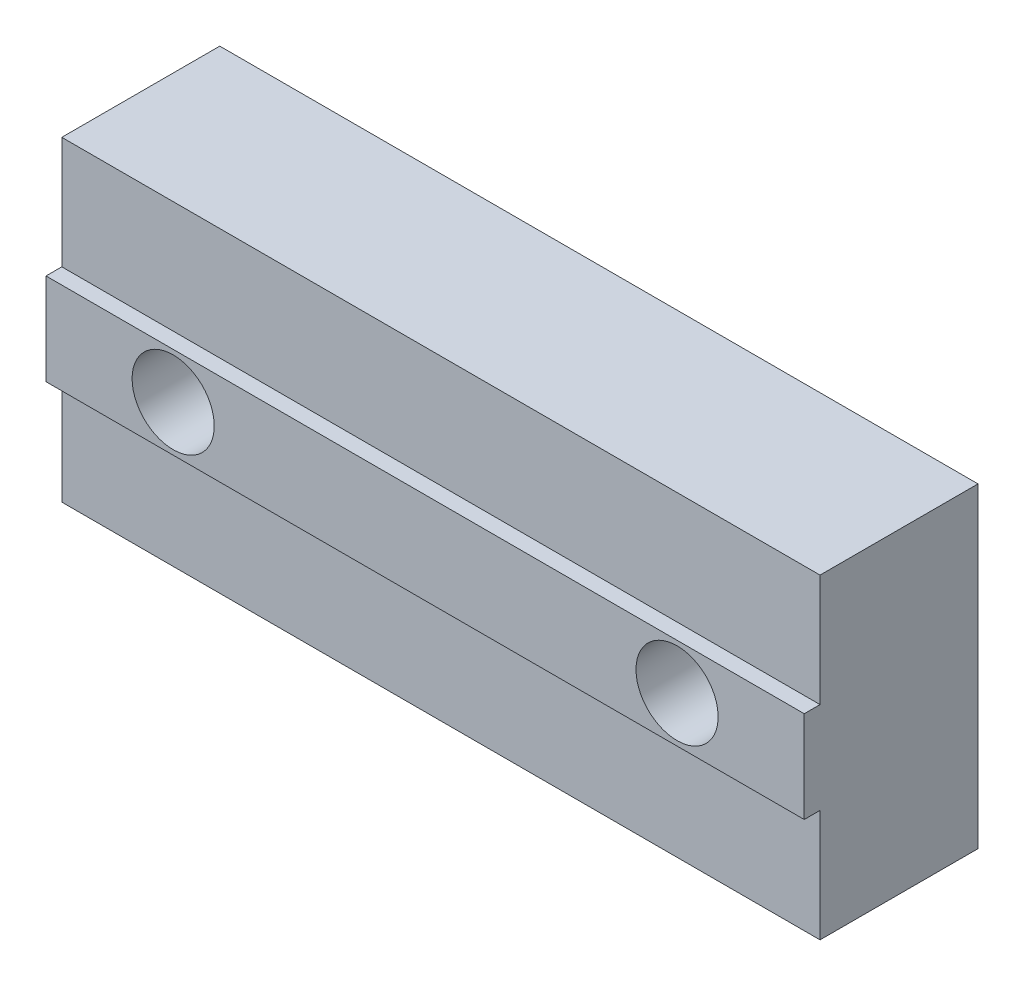
ISO-10303-21;
HEADER;
FILE_DESCRIPTION(('STEP AP214'),'2;1');
FILE_NAME('part.step','',(''),(''),'','','');
FILE_SCHEMA(('AUTOMOTIVE_DESIGN { 1 0 10303 214 1 1 1 1 }'));
ENDSEC;
DATA;
#1=APPLICATION_CONTEXT('core data for automotive mechanical design processes');
#2=APPLICATION_PROTOCOL_DEFINITION('international standard','automotive_design',2000,#1);
#3=PRODUCT_CONTEXT('',#1,'mechanical');
#4=PRODUCT('Part','Part','',(#3));
#5=PRODUCT_RELATED_PRODUCT_CATEGORY('part','',(#4));
#6=PRODUCT_DEFINITION_FORMATION('','',#4);
#7=PRODUCT_DEFINITION_CONTEXT('part definition',#1,'design');
#8=PRODUCT_DEFINITION('design','',#6,#7);
#9=PRODUCT_DEFINITION_SHAPE('','',#8);
#10=(LENGTH_UNIT() NAMED_UNIT(*) SI_UNIT(.MILLI.,.METRE.));
#11=(NAMED_UNIT(*) PLANE_ANGLE_UNIT() SI_UNIT($,.RADIAN.));
#12=(NAMED_UNIT(*) SI_UNIT($,.STERADIAN.) SOLID_ANGLE_UNIT());
#13=UNCERTAINTY_MEASURE_WITH_UNIT(LENGTH_MEASURE(1.E-05),#10,'distance_accuracy_value','');
#14=(GEOMETRIC_REPRESENTATION_CONTEXT(3) GLOBAL_UNCERTAINTY_ASSIGNED_CONTEXT((#13)) GLOBAL_UNIT_ASSIGNED_CONTEXT((#10,
#11,#12)) REPRESENTATION_CONTEXT('',''));
#15=CARTESIAN_POINT('',(0.,0.,0.));
#16=DIRECTION('',(0.,0.,1.));
#17=DIRECTION('',(1.,0.,0.));
#18=AXIS2_PLACEMENT_3D('',#15,#16,#17);
#19=CARTESIAN_POINT('',(24.,10.,0.));
#20=DIRECTION('',(0.,0.,-1.));
#21=DIRECTION('',(-1.,0.,0.));
#22=AXIS2_PLACEMENT_3D('',#19,#20,#21);
#23=PLANE('',#22);
#24=CARTESIAN_POINT('',(15.95,0.,0.));
#25=DIRECTION('',(0.,0.,-1.));
#26=DIRECTION('',(-1.,0.,0.));
#27=AXIS2_PLACEMENT_3D('',#24,#25,#26);
#28=CIRCLE('',#27,2.6);
#29=CARTESIAN_POINT('',(13.35,0.,0.));
#30=VERTEX_POINT('',#29);
#31=EDGE_CURVE('E194',#30,#30,#28,.T.);
#32=ORIENTED_EDGE('',*,*,#31,.F.);
#33=EDGE_LOOP('',(#32));
#34=FACE_BOUND('',#33,.T.);
#35=DIRECTION('',(0.,1.,0.));
#36=VECTOR('',#35,1.);
#37=CARTESIAN_POINT('',(24.,-10.,0.));
#38=LINE('',#37,#36);
#39=CARTESIAN_POINT('',(24.,-10.,0.));
#40=VERTEX_POINT('',#39);
#41=CARTESIAN_POINT('',(24.,10.,0.));
#42=VERTEX_POINT('',#41);
#43=EDGE_CURVE('E126',#40,#42,#38,.T.);
#44=ORIENTED_EDGE('',*,*,#43,.F.);
#45=DIRECTION('',(1.,0.,0.));
#46=VECTOR('',#45,1.);
#47=CARTESIAN_POINT('',(-24.,-10.,0.));
#48=LINE('',#47,#46);
#49=CARTESIAN_POINT('',(-24.,-10.,0.));
#50=VERTEX_POINT('',#49);
#51=EDGE_CURVE('E165',#50,#40,#48,.T.);
#52=ORIENTED_EDGE('',*,*,#51,.F.);
#53=DIRECTION('',(0.,-1.,0.));
#54=VECTOR('',#53,1.);
#55=CARTESIAN_POINT('',(-24.,-10.,0.));
#56=LINE('',#55,#54);
#57=CARTESIAN_POINT('',(-24.,10.,0.));
#58=VERTEX_POINT('',#57);
#59=EDGE_CURVE('E167',#58,#50,#56,.T.);
#60=ORIENTED_EDGE('',*,*,#59,.F.);
#61=DIRECTION('',(-1.,0.,0.));
#62=VECTOR('',#61,1.);
#63=CARTESIAN_POINT('',(-24.,10.,0.));
#64=LINE('',#63,#62);
#65=EDGE_CURVE('E128',#42,#58,#64,.T.);
#66=ORIENTED_EDGE('',*,*,#65,.F.);
#67=EDGE_LOOP('',(#44,#52,#60,#66));
#68=FACE_BOUND('',#67,.T.);
#69=CARTESIAN_POINT('',(-15.95,0.,0.));
#70=DIRECTION('',(0.,0.,1.));
#71=DIRECTION('',(1.,0.,0.));
#72=AXIS2_PLACEMENT_3D('',#69,#70,#71);
#73=CIRCLE('',#72,2.6);
#74=CARTESIAN_POINT('',(-13.35,0.,0.));
#75=VERTEX_POINT('',#74);
#76=EDGE_CURVE('E190',#75,#75,#73,.T.);
#77=ORIENTED_EDGE('',*,*,#76,.T.);
#78=EDGE_LOOP('',(#77));
#79=FACE_BOUND('',#78,.T.);
#80=ADVANCED_FACE('F35',(#34,#68,#79),#23,.T.);
#81=CARTESIAN_POINT('',(24.,2.9,11.));
#82=DIRECTION('',(0.,0.,-1.));
#83=DIRECTION('',(-1.,0.,0.));
#84=AXIS2_PLACEMENT_3D('',#81,#82,#83);
#85=PLANE('',#84);
#86=CARTESIAN_POINT('',(15.95,0.,11.));
#87=DIRECTION('',(0.,0.,-1.));
#88=DIRECTION('',(-1.,0.,0.));
#89=AXIS2_PLACEMENT_3D('',#86,#87,#88);
#90=CIRCLE('',#89,2.6);
#91=CARTESIAN_POINT('',(13.35,0.,11.));
#92=VERTEX_POINT('',#91);
#93=EDGE_CURVE('E39',#92,#92,#90,.T.);
#94=ORIENTED_EDGE('',*,*,#93,.T.);
#95=EDGE_LOOP('',(#94));
#96=FACE_BOUND('',#95,.T.);
#97=DIRECTION('',(0.,1.,0.));
#98=VECTOR('',#97,1.);
#99=CARTESIAN_POINT('',(24.,-2.9,11.));
#100=LINE('',#99,#98);
#101=CARTESIAN_POINT('',(24.,-2.9,11.));
#102=VERTEX_POINT('',#101);
#103=CARTESIAN_POINT('',(24.,2.9,11.));
#104=VERTEX_POINT('',#103);
#105=EDGE_CURVE('E112',#102,#104,#100,.T.);
#106=ORIENTED_EDGE('',*,*,#105,.T.);
#107=DIRECTION('',(-1.,0.,0.));
#108=VECTOR('',#107,1.);
#109=CARTESIAN_POINT('',(-24.,2.9,11.));
#110=LINE('',#109,#108);
#111=CARTESIAN_POINT('',(-24.,2.9,11.));
#112=VERTEX_POINT('',#111);
#113=EDGE_CURVE('E102',#104,#112,#110,.T.);
#114=ORIENTED_EDGE('',*,*,#113,.T.);
#115=DIRECTION('',(0.,-1.,0.));
#116=VECTOR('',#115,1.);
#117=CARTESIAN_POINT('',(-24.,-2.9,11.));
#118=LINE('',#117,#116);
#119=CARTESIAN_POINT('',(-24.,-2.9,11.));
#120=VERTEX_POINT('',#119);
#121=EDGE_CURVE('E111',#112,#120,#118,.T.);
#122=ORIENTED_EDGE('',*,*,#121,.T.);
#123=DIRECTION('',(1.,0.,0.));
#124=VECTOR('',#123,1.);
#125=CARTESIAN_POINT('',(-24.,-2.9,11.));
#126=LINE('',#125,#124);
#127=EDGE_CURVE('E118',#120,#102,#126,.T.);
#128=ORIENTED_EDGE('',*,*,#127,.T.);
#129=EDGE_LOOP('',(#106,#114,#122,#128));
#130=FACE_BOUND('',#129,.T.);
#131=CARTESIAN_POINT('',(-15.95,0.,11.));
#132=DIRECTION('',(0.,0.,-1.));
#133=DIRECTION('',(-1.,0.,0.));
#134=AXIS2_PLACEMENT_3D('',#131,#132,#133);
#135=CIRCLE('',#134,2.6);
#136=CARTESIAN_POINT('',(-18.55,0.,11.));
#137=VERTEX_POINT('',#136);
#138=EDGE_CURVE('E193',#137,#137,#135,.F.);
#139=ORIENTED_EDGE('',*,*,#138,.F.);
#140=EDGE_LOOP('',(#139));
#141=FACE_BOUND('',#140,.T.);
#142=ADVANCED_FACE('F115',(#96,#130,#141),#85,.F.);
#143=CARTESIAN_POINT('',(24.,10.,10.));
#144=DIRECTION('',(0.,0.,-1.));
#145=DIRECTION('',(-1.,0.,0.));
#146=AXIS2_PLACEMENT_3D('',#143,#144,#145);
#147=PLANE('',#146);
#148=DIRECTION('',(1.,0.,0.));
#149=VECTOR('',#148,1.);
#150=CARTESIAN_POINT('',(-24.,-2.9,10.));
#151=LINE('',#150,#149);
#152=CARTESIAN_POINT('',(-24.,-2.9,10.));
#153=VERTEX_POINT('',#152);
#154=CARTESIAN_POINT('',(24.,-2.9,10.));
#155=VERTEX_POINT('',#154);
#156=EDGE_CURVE('E52',#153,#155,#151,.T.);
#157=ORIENTED_EDGE('',*,*,#156,.F.);
#158=DIRECTION('',(0.,-1.,0.));
#159=VECTOR('',#158,1.);
#160=CARTESIAN_POINT('',(-24.,-10.,10.));
#161=LINE('',#160,#159);
#162=CARTESIAN_POINT('',(-24.,-10.,10.));
#163=VERTEX_POINT('',#162);
#164=EDGE_CURVE('E174',#153,#163,#161,.T.);
#165=ORIENTED_EDGE('',*,*,#164,.T.);
#166=DIRECTION('',(1.,0.,0.));
#167=VECTOR('',#166,1.);
#168=CARTESIAN_POINT('',(-24.,-10.,10.));
#169=LINE('',#168,#167);
#170=CARTESIAN_POINT('',(24.,-10.,10.));
#171=VERTEX_POINT('',#170);
#172=EDGE_CURVE('E164',#163,#171,#169,.T.);
#173=ORIENTED_EDGE('',*,*,#172,.T.);
#174=DIRECTION('',(0.,1.,0.));
#175=VECTOR('',#174,1.);
#176=CARTESIAN_POINT('',(24.,-10.,10.));
#177=LINE('',#176,#175);
#178=EDGE_CURVE('E154',#171,#155,#177,.T.);
#179=ORIENTED_EDGE('',*,*,#178,.T.);
#180=EDGE_LOOP('',(#157,#165,#173,#179));
#181=FACE_BOUND('',#180,.T.);
#182=ADVANCED_FACE('F218',(#181),#147,.F.);
#183=DIRECTION('',(-1.,0.,0.));
#184=VECTOR('',#183,1.);
#185=CARTESIAN_POINT('',(-24.,2.9,10.));
#186=LINE('',#185,#184);
#187=CARTESIAN_POINT('',(24.,2.9,10.));
#188=VERTEX_POINT('',#187);
#189=CARTESIAN_POINT('',(-24.,2.9,10.));
#190=VERTEX_POINT('',#189);
#191=EDGE_CURVE('E60',#188,#190,#186,.T.);
#192=ORIENTED_EDGE('',*,*,#191,.F.);
#193=CARTESIAN_POINT('',(24.,10.,10.));
#194=VERTEX_POINT('',#193);
#195=EDGE_CURVE('E125',#188,#194,#177,.T.);
#196=ORIENTED_EDGE('',*,*,#195,.T.);
#197=DIRECTION('',(-1.,0.,0.));
#198=VECTOR('',#197,1.);
#199=CARTESIAN_POINT('',(-24.,10.,10.));
#200=LINE('',#199,#198);
#201=CARTESIAN_POINT('',(-24.,10.,10.));
#202=VERTEX_POINT('',#201);
#203=EDGE_CURVE('E148',#194,#202,#200,.T.);
#204=ORIENTED_EDGE('',*,*,#203,.T.);
#205=EDGE_CURVE('E170',#202,#190,#161,.T.);
#206=ORIENTED_EDGE('',*,*,#205,.T.);
#207=EDGE_LOOP('',(#192,#196,#204,#206));
#208=FACE_BOUND('',#207,.T.);
#209=ADVANCED_FACE('F180',(#208),#147,.F.);
#210=CARTESIAN_POINT('',(24.,-10.,10.));
#211=DIRECTION('',(-1.,0.,0.));
#212=DIRECTION('',(0.,0.,1.));
#213=AXIS2_PLACEMENT_3D('',#210,#211,#212);
#214=PLANE('',#213);
#215=ORIENTED_EDGE('',*,*,#43,.T.);
#216=DIRECTION('',(0.,0.,-1.));
#217=VECTOR('',#216,1.);
#218=CARTESIAN_POINT('',(24.,10.,10.));
#219=LINE('',#218,#217);
#220=EDGE_CURVE('E11',#194,#42,#219,.T.);
#221=ORIENTED_EDGE('',*,*,#220,.F.);
#222=ORIENTED_EDGE('',*,*,#195,.F.);
#223=DIRECTION('',(0.,0.,-1.));
#224=VECTOR('',#223,1.);
#225=CARTESIAN_POINT('',(24.,2.9,11.));
#226=LINE('',#225,#224);
#227=EDGE_CURVE('E106',#104,#188,#226,.T.);
#228=ORIENTED_EDGE('',*,*,#227,.F.);
#229=ORIENTED_EDGE('',*,*,#105,.F.);
#230=DIRECTION('',(0.,0.,-1.));
#231=VECTOR('',#230,1.);
#232=CARTESIAN_POINT('',(24.,-2.9,11.));
#233=LINE('',#232,#231);
#234=EDGE_CURVE('E139',#102,#155,#233,.T.);
#235=ORIENTED_EDGE('',*,*,#234,.T.);
#236=ORIENTED_EDGE('',*,*,#178,.F.);
#237=DIRECTION('',(0.,0.,-1.));
#238=VECTOR('',#237,1.);
#239=CARTESIAN_POINT('',(24.,-10.,10.));
#240=LINE('',#239,#238);
#241=EDGE_CURVE('E161',#171,#40,#240,.T.);
#242=ORIENTED_EDGE('',*,*,#241,.T.);
#243=EDGE_LOOP('',(#215,#221,#222,#228,#229,#235,#236,#242));
#244=FACE_BOUND('',#243,.T.);
#245=ADVANCED_FACE('F37',(#244),#214,.F.);
#246=CARTESIAN_POINT('',(-24.,10.,10.));
#247=DIRECTION('',(0.,-1.,0.));
#248=DIRECTION('',(0.,0.,-1.));
#249=AXIS2_PLACEMENT_3D('',#246,#247,#248);
#250=PLANE('',#249);
#251=ORIENTED_EDGE('',*,*,#65,.T.);
#252=DIRECTION('',(0.,0.,-1.));
#253=VECTOR('',#252,1.);
#254=CARTESIAN_POINT('',(-24.,10.,10.));
#255=LINE('',#254,#253);
#256=EDGE_CURVE('E44',#202,#58,#255,.T.);
#257=ORIENTED_EDGE('',*,*,#256,.F.);
#258=ORIENTED_EDGE('',*,*,#203,.F.);
#259=ORIENTED_EDGE('',*,*,#220,.T.);
#260=EDGE_LOOP('',(#251,#257,#258,#259));
#261=FACE_BOUND('',#260,.T.);
#262=ADVANCED_FACE('F182',(#261),#250,.F.);
#263=CARTESIAN_POINT('',(-24.,-10.,10.));
#264=DIRECTION('',(1.,0.,0.));
#265=DIRECTION('',(0.,0.,-1.));
#266=AXIS2_PLACEMENT_3D('',#263,#264,#265);
#267=PLANE('',#266);
#268=ORIENTED_EDGE('',*,*,#59,.T.);
#269=DIRECTION('',(0.,0.,-1.));
#270=VECTOR('',#269,1.);
#271=CARTESIAN_POINT('',(-24.,-10.,10.));
#272=LINE('',#271,#270);
#273=EDGE_CURVE('E158',#163,#50,#272,.T.);
#274=ORIENTED_EDGE('',*,*,#273,.F.);
#275=ORIENTED_EDGE('',*,*,#164,.F.);
#276=DIRECTION('',(0.,0.,-1.));
#277=VECTOR('',#276,1.);
#278=CARTESIAN_POINT('',(-24.,-2.9,11.));
#279=LINE('',#278,#277);
#280=EDGE_CURVE('E130',#120,#153,#279,.T.);
#281=ORIENTED_EDGE('',*,*,#280,.F.);
#282=ORIENTED_EDGE('',*,*,#121,.F.);
#283=DIRECTION('',(0.,0.,-1.));
#284=VECTOR('',#283,1.);
#285=CARTESIAN_POINT('',(-24.,2.9,11.));
#286=LINE('',#285,#284);
#287=EDGE_CURVE('E108',#112,#190,#286,.T.);
#288=ORIENTED_EDGE('',*,*,#287,.T.);
#289=ORIENTED_EDGE('',*,*,#205,.F.);
#290=ORIENTED_EDGE('',*,*,#256,.T.);
#291=EDGE_LOOP('',(#268,#274,#275,#281,#282,#288,#289,#290));
#292=FACE_BOUND('',#291,.T.);
#293=ADVANCED_FACE('F185',(#292),#267,.F.);
#294=CARTESIAN_POINT('',(-24.,-10.,10.));
#295=DIRECTION('',(0.,1.,0.));
#296=DIRECTION('',(0.,0.,1.));
#297=AXIS2_PLACEMENT_3D('',#294,#295,#296);
#298=PLANE('',#297);
#299=ORIENTED_EDGE('',*,*,#51,.T.);
#300=ORIENTED_EDGE('',*,*,#241,.F.);
#301=ORIENTED_EDGE('',*,*,#172,.F.);
#302=ORIENTED_EDGE('',*,*,#273,.T.);
#303=EDGE_LOOP('',(#299,#300,#301,#302));
#304=FACE_BOUND('',#303,.T.);
#305=ADVANCED_FACE('F224',(#304),#298,.F.);
#306=CARTESIAN_POINT('',(-24.,2.9,11.));
#307=DIRECTION('',(0.,-1.,0.));
#308=DIRECTION('',(0.,0.,-1.));
#309=AXIS2_PLACEMENT_3D('',#306,#307,#308);
#310=PLANE('',#309);
#311=ORIENTED_EDGE('',*,*,#191,.T.);
#312=ORIENTED_EDGE('',*,*,#287,.F.);
#313=ORIENTED_EDGE('',*,*,#113,.F.);
#314=ORIENTED_EDGE('',*,*,#227,.T.);
#315=EDGE_LOOP('',(#311,#312,#313,#314));
#316=FACE_BOUND('',#315,.T.);
#317=ADVANCED_FACE('F104',(#316),#310,.F.);
#318=CARTESIAN_POINT('',(-24.,-2.9,11.));
#319=DIRECTION('',(0.,1.,0.));
#320=DIRECTION('',(0.,0.,1.));
#321=AXIS2_PLACEMENT_3D('',#318,#319,#320);
#322=PLANE('',#321);
#323=ORIENTED_EDGE('',*,*,#156,.T.);
#324=ORIENTED_EDGE('',*,*,#234,.F.);
#325=ORIENTED_EDGE('',*,*,#127,.F.);
#326=ORIENTED_EDGE('',*,*,#280,.T.);
#327=EDGE_LOOP('',(#323,#324,#325,#326));
#328=FACE_BOUND('',#327,.T.);
#329=ADVANCED_FACE('F209',(#328),#322,.F.);
#330=CARTESIAN_POINT('',(-15.95,0.,11.000025));
#331=DIRECTION('',(0.,0.,-1.));
#332=DIRECTION('',(-1.,0.,0.));
#333=AXIS2_PLACEMENT_3D('',#330,#331,#332);
#334=CYLINDRICAL_SURFACE('',#333,2.6);
#335=ORIENTED_EDGE('',*,*,#76,.F.);
#336=EDGE_LOOP('',(#335));
#337=FACE_BOUND('',#336,.T.);
#338=ORIENTED_EDGE('',*,*,#138,.T.);
#339=EDGE_LOOP('',(#338));
#340=FACE_BOUND('',#339,.T.);
#341=ADVANCED_FACE('F204',(#337,#340),#334,.F.);
#342=CARTESIAN_POINT('',(15.95,0.,11.000025));
#343=DIRECTION('',(0.,0.,-1.));
#344=DIRECTION('',(-1.,0.,0.));
#345=AXIS2_PLACEMENT_3D('',#342,#343,#344);
#346=CYLINDRICAL_SURFACE('',#345,2.6);
#347=ORIENTED_EDGE('',*,*,#31,.T.);
#348=EDGE_LOOP('',(#347));
#349=FACE_BOUND('',#348,.T.);
#350=ORIENTED_EDGE('',*,*,#93,.F.);
#351=EDGE_LOOP('',(#350));
#352=FACE_BOUND('',#351,.T.);
#353=ADVANCED_FACE('F202',(#349,#352),#346,.F.);
#354=CLOSED_SHELL('',(#80,#142,#182,#209,#245,#262,#293,#305,#317,#329,#341,#353));
#355=MANIFOLD_SOLID_BREP('B2',#354);
#356=ADVANCED_BREP_SHAPE_REPRESENTATION('',(#18,#355),#14);
#357=SHAPE_DEFINITION_REPRESENTATION(#9,#356);
ENDSEC;
END-ISO-10303-21;
